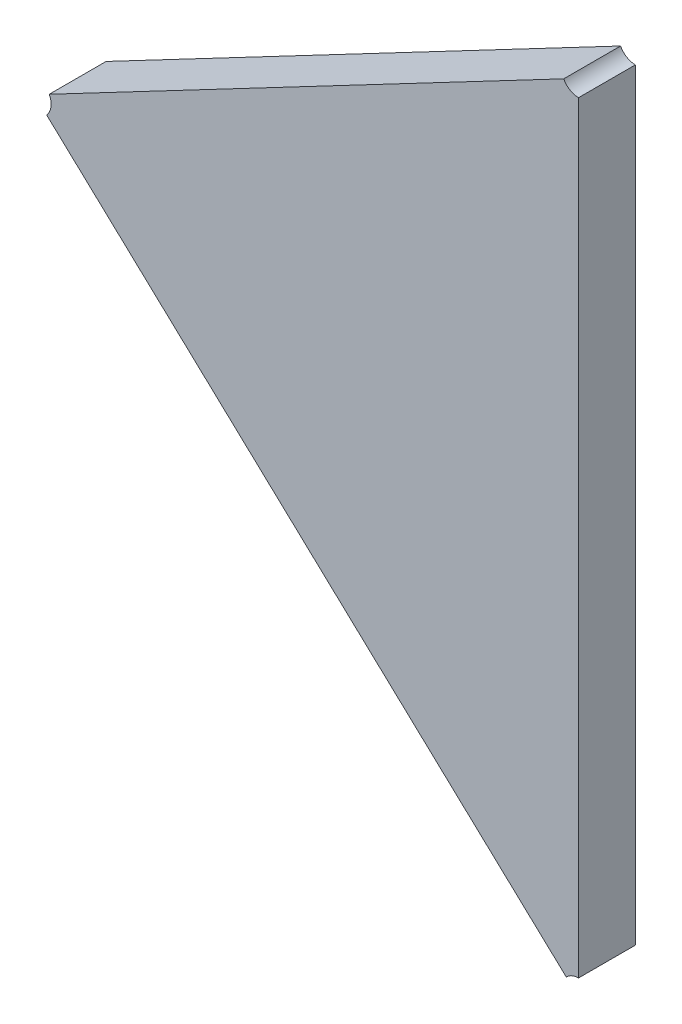
ISO-10303-21;
HEADER;
FILE_DESCRIPTION(('STEP AP214'),'2;1');
FILE_NAME('part.step','',(''),(''),'','','');
FILE_SCHEMA(('AUTOMOTIVE_DESIGN { 1 0 10303 214 1 1 1 1 }'));
ENDSEC;
DATA;
#1=APPLICATION_CONTEXT('core data for automotive mechanical design processes');
#2=APPLICATION_PROTOCOL_DEFINITION('international standard','automotive_design',2000,#1);
#3=PRODUCT_CONTEXT('',#1,'mechanical');
#4=PRODUCT('Part','Part','',(#3));
#5=PRODUCT_RELATED_PRODUCT_CATEGORY('part','',(#4));
#6=PRODUCT_DEFINITION_FORMATION('','',#4);
#7=PRODUCT_DEFINITION_CONTEXT('part definition',#1,'design');
#8=PRODUCT_DEFINITION('design','',#6,#7);
#9=PRODUCT_DEFINITION_SHAPE('','',#8);
#10=(LENGTH_UNIT() NAMED_UNIT(*) SI_UNIT(.MILLI.,.METRE.));
#11=(NAMED_UNIT(*) PLANE_ANGLE_UNIT() SI_UNIT($,.RADIAN.));
#12=(NAMED_UNIT(*) SI_UNIT($,.STERADIAN.) SOLID_ANGLE_UNIT());
#13=UNCERTAINTY_MEASURE_WITH_UNIT(LENGTH_MEASURE(1.E-05),#10,'distance_accuracy_value','');
#14=(GEOMETRIC_REPRESENTATION_CONTEXT(3) GLOBAL_UNCERTAINTY_ASSIGNED_CONTEXT((#13)) GLOBAL_UNIT_ASSIGNED_CONTEXT((#10,
#11,#12)) REPRESENTATION_CONTEXT('',''));
#15=CARTESIAN_POINT('',(0.,0.,0.));
#16=DIRECTION('',(0.,0.,1.));
#17=DIRECTION('',(1.,0.,0.));
#18=AXIS2_PLACEMENT_3D('',#15,#16,#17);
#19=CARTESIAN_POINT('',(-1.32073989294773,-1.28570071400538,0.0042));
#20=DIRECTION('',(0.,0.,1.));
#21=DIRECTION('',(1.,0.,0.));
#22=AXIS2_PLACEMENT_3D('',#19,#20,#21);
#23=PLANE('',#22);
#24=CARTESIAN_POINT('',(-1.31045874865729,-1.26331224779158,0.0042));
#25=DIRECTION('',(0.,0.,-1.));
#26=DIRECTION('',(0.,-1.,0.));
#27=AXIS2_PLACEMENT_3D('',#24,#25,#26);
#28=CIRCLE('',#27,0.00100000000000001);
#29=CARTESIAN_POINT('',(-1.31045874865729,-1.26431224779158,0.0042));
#30=VERTEX_POINT('',#29);
#31=CARTESIAN_POINT('',(-1.31134378812502,-1.26377776378545,0.0042));
#32=VERTEX_POINT('',#31);
#33=EDGE_CURVE('E11',#30,#32,#28,.T.);
#34=ORIENTED_EDGE('',*,*,#33,.T.);
#35=DIRECTION('',(-0.88503946773786,-0.465515993867326,0.));
#36=VECTOR('',#35,1.);
#37=CARTESIAN_POINT('',(-1.31134378812502,-1.26377776378545,0.0042));
#38=LINE('',#37,#36);
#39=CARTESIAN_POINT('',(-1.342108317435,-1.27995939292138,0.0042));
#40=VERTEX_POINT('',#39);
#41=EDGE_CURVE('E113',#32,#40,#38,.T.);
#42=ORIENTED_EDGE('',*,*,#41,.T.);
#43=CARTESIAN_POINT('',(-1.34299335690274,-1.28042490891524,0.0042));
#44=DIRECTION('',(0.,0.,-1.));
#45=DIRECTION('',(0.885039467741346,0.4655159938607,0.));
#46=AXIS2_PLACEMENT_3D('',#43,#44,#45);
#47=CIRCLE('',#46,0.00100000000000001);
#48=CARTESIAN_POINT('',(-1.34226353505596,-1.28110854629863,0.0042));
#49=VERTEX_POINT('',#48);
#50=EDGE_CURVE('E107',#40,#49,#47,.T.);
#51=ORIENTED_EDGE('',*,*,#50,.T.);
#52=DIRECTION('',(0.729821846781323,-0.683637383384422,0.));
#53=VECTOR('',#52,1.);
#54=CARTESIAN_POINT('',(-1.34226353505596,-1.28110854629863,0.0042));
#55=LINE('',#54,#53);
#56=CARTESIAN_POINT('',(-1.31118857050407,-1.31021703016864,0.0042));
#57=VERTEX_POINT('',#56);
#58=EDGE_CURVE('E71',#49,#57,#55,.T.);
#59=ORIENTED_EDGE('',*,*,#58,.T.);
#60=CARTESIAN_POINT('',(-1.31045874865729,-1.31090066755203,0.0042));
#61=DIRECTION('',(0.,0.,-1.));
#62=DIRECTION('',(-0.72982184677793,0.683637383388044,0.));
#63=AXIS2_PLACEMENT_3D('',#60,#61,#62);
#64=CIRCLE('',#63,0.00100000000000001);
#65=CARTESIAN_POINT('',(-1.31045874865729,-1.30990066755203,0.0042));
#66=VERTEX_POINT('',#65);
#67=EDGE_CURVE('E67',#57,#66,#64,.T.);
#68=ORIENTED_EDGE('',*,*,#67,.T.);
#69=DIRECTION('',(0.,1.,0.));
#70=VECTOR('',#69,1.);
#71=CARTESIAN_POINT('',(-1.31045874865729,-1.30990066755203,0.0042));
#72=LINE('',#71,#70);
#73=EDGE_CURVE('E69',#66,#30,#72,.T.);
#74=ORIENTED_EDGE('',*,*,#73,.T.);
#75=EDGE_LOOP('',(#34,#42,#51,#59,#68,#74));
#76=FACE_BOUND('',#75,.T.);
#77=ADVANCED_FACE('F17',(#76),#23,.T.);
#78=CARTESIAN_POINT('',(-1.32072164733338,-1.28572023478097,0.0008));
#79=DIRECTION('',(0.,0.,1.));
#80=DIRECTION('',(1.,0.,0.));
#81=AXIS2_PLACEMENT_3D('',#78,#79,#80);
#82=PLANE('',#81);
#83=CARTESIAN_POINT('',(-1.31045874865729,-1.26331224779158,0.0008));
#84=DIRECTION('',(0.,0.,1.));
#85=DIRECTION('',(-0.88503946773515,-0.46551599387248,0.));
#86=AXIS2_PLACEMENT_3D('',#83,#84,#85);
#87=CIRCLE('',#86,0.00100000000000001);
#88=CARTESIAN_POINT('',(-1.31134378812502,-1.26377776378545,0.0008));
#89=VERTEX_POINT('',#88);
#90=CARTESIAN_POINT('',(-1.31045874865729,-1.26431224779158,0.0008));
#91=VERTEX_POINT('',#90);
#92=EDGE_CURVE('E24',#89,#91,#87,.T.);
#93=ORIENTED_EDGE('',*,*,#92,.T.);
#94=DIRECTION('',(0.,1.,0.));
#95=VECTOR('',#94,1.);
#96=CARTESIAN_POINT('',(-1.31045874865729,-1.30990066755203,0.0008));
#97=LINE('',#96,#95);
#98=CARTESIAN_POINT('',(-1.31045874865729,-1.30990066755203,0.0008));
#99=VERTEX_POINT('',#98);
#100=EDGE_CURVE('E109',#99,#91,#97,.T.);
#101=ORIENTED_EDGE('',*,*,#100,.F.);
#102=CARTESIAN_POINT('',(-1.31045874865729,-1.31090066755203,0.0008));
#103=DIRECTION('',(0.,0.,1.));
#104=DIRECTION('',(0.,1.,0.));
#105=AXIS2_PLACEMENT_3D('',#102,#103,#104);
#106=CIRCLE('',#105,0.00100000000000001);
#107=CARTESIAN_POINT('',(-1.31118857050407,-1.31021703016864,0.0008));
#108=VERTEX_POINT('',#107);
#109=EDGE_CURVE('E87',#99,#108,#106,.T.);
#110=ORIENTED_EDGE('',*,*,#109,.T.);
#111=DIRECTION('',(0.729821846781321,-0.683637383384424,0.));
#112=VECTOR('',#111,1.);
#113=CARTESIAN_POINT('',(-1.34226353505596,-1.28110854629863,0.0008));
#114=LINE('',#113,#112);
#115=CARTESIAN_POINT('',(-1.34226353505596,-1.28110854629863,0.0008));
#116=VERTEX_POINT('',#115);
#117=EDGE_CURVE('E75',#116,#108,#114,.T.);
#118=ORIENTED_EDGE('',*,*,#117,.F.);
#119=CARTESIAN_POINT('',(-1.34299335690274,-1.28042490891524,0.0008));
#120=DIRECTION('',(0.,0.,1.));
#121=DIRECTION('',(0.72982184677793,-0.683637383388044,0.));
#122=AXIS2_PLACEMENT_3D('',#119,#120,#121);
#123=CIRCLE('',#122,0.00100000000000001);
#124=CARTESIAN_POINT('',(-1.342108317435,-1.27995939292138,0.0008));
#125=VERTEX_POINT('',#124);
#126=EDGE_CURVE('E88',#116,#125,#123,.T.);
#127=ORIENTED_EDGE('',*,*,#126,.T.);
#128=DIRECTION('',(-0.885039467737863,-0.465515993867321,0.));
#129=VECTOR('',#128,1.);
#130=CARTESIAN_POINT('',(-1.31134378812502,-1.26377776378544,0.0008));
#131=LINE('',#130,#129);
#132=EDGE_CURVE('E103',#89,#125,#131,.T.);
#133=ORIENTED_EDGE('',*,*,#132,.F.);
#134=EDGE_LOOP('',(#93,#101,#110,#118,#127,#133));
#135=FACE_BOUND('',#134,.T.);
#136=ADVANCED_FACE('F125',(#135),#82,.F.);
#137=CARTESIAN_POINT('',(-1.31045874865729,-1.26331224779158,0.0008));
#138=DIRECTION('',(-0.465515993867324,0.885039467737862,0.));
#139=DIRECTION('',(-0.885039467737862,-0.465515993867324,0.));
#140=AXIS2_PLACEMENT_3D('',#137,#138,#139);
#141=PLANE('',#140);
#142=DIRECTION('',(0.,0.,-1.));
#143=VECTOR('',#142,1.);
#144=CARTESIAN_POINT('',(-1.31134378812502,-1.26377776378545,0.0042));
#145=LINE('',#144,#143);
#146=EDGE_CURVE('E111',#32,#89,#145,.T.);
#147=ORIENTED_EDGE('',*,*,#146,.T.);
#148=ORIENTED_EDGE('',*,*,#132,.T.);
#149=DIRECTION('',(0.,0.,1.));
#150=VECTOR('',#149,1.);
#151=CARTESIAN_POINT('',(-1.342108317435,-1.27995939292138,0.0008));
#152=LINE('',#151,#150);
#153=EDGE_CURVE('E97',#125,#40,#152,.T.);
#154=ORIENTED_EDGE('',*,*,#153,.T.);
#155=ORIENTED_EDGE('',*,*,#41,.F.);
#156=EDGE_LOOP('',(#147,#148,#154,#155));
#157=FACE_BOUND('',#156,.T.);
#158=ADVANCED_FACE('F118',(#157),#141,.T.);
#159=CARTESIAN_POINT('',(-1.34299335690274,-1.28042490891524,0.0008));
#160=DIRECTION('',(-0.683637383384425,-0.729821846781321,0.));
#161=DIRECTION('',(0.729821846781321,-0.683637383384425,0.));
#162=AXIS2_PLACEMENT_3D('',#159,#160,#161);
#163=PLANE('',#162);
#164=DIRECTION('',(0.,0.,1.));
#165=VECTOR('',#164,1.);
#166=CARTESIAN_POINT('',(-1.31118857050407,-1.31021703016864,0.0008));
#167=LINE('',#166,#165);
#168=EDGE_CURVE('E105',#108,#57,#167,.T.);
#169=ORIENTED_EDGE('',*,*,#168,.T.);
#170=ORIENTED_EDGE('',*,*,#58,.F.);
#171=DIRECTION('',(0.,0.,-1.));
#172=VECTOR('',#171,1.);
#173=CARTESIAN_POINT('',(-1.34226353505596,-1.28110854629863,0.0042));
#174=LINE('',#173,#172);
#175=EDGE_CURVE('E84',#49,#116,#174,.T.);
#176=ORIENTED_EDGE('',*,*,#175,.T.);
#177=ORIENTED_EDGE('',*,*,#117,.T.);
#178=EDGE_LOOP('',(#169,#170,#176,#177));
#179=FACE_BOUND('',#178,.T.);
#180=ADVANCED_FACE('F124',(#179),#163,.T.);
#181=CARTESIAN_POINT('',(-1.31045874865729,-1.31090066755203,0.0008));
#182=DIRECTION('',(1.,0.,0.));
#183=DIRECTION('',(0.,1.,0.));
#184=AXIS2_PLACEMENT_3D('',#181,#182,#183);
#185=PLANE('',#184);
#186=DIRECTION('',(0.,0.,1.));
#187=VECTOR('',#186,1.);
#188=CARTESIAN_POINT('',(-1.31045874865729,-1.26431224779158,0.0008));
#189=LINE('',#188,#187);
#190=EDGE_CURVE('E83',#91,#30,#189,.T.);
#191=ORIENTED_EDGE('',*,*,#190,.T.);
#192=ORIENTED_EDGE('',*,*,#73,.F.);
#193=DIRECTION('',(0.,0.,-1.));
#194=VECTOR('',#193,1.);
#195=CARTESIAN_POINT('',(-1.31045874865729,-1.30990066755203,0.0042));
#196=LINE('',#195,#194);
#197=EDGE_CURVE('E80',#66,#99,#196,.T.);
#198=ORIENTED_EDGE('',*,*,#197,.T.);
#199=ORIENTED_EDGE('',*,*,#100,.T.);
#200=EDGE_LOOP('',(#191,#192,#198,#199));
#201=FACE_BOUND('',#200,.T.);
#202=ADVANCED_FACE('F79',(#201),#185,.T.);
#203=CARTESIAN_POINT('',(-1.34299335690274,-1.28042490891524,0.0012));
#204=DIRECTION('',(0.,0.,1.));
#205=DIRECTION('',(0.991000826132297,-0.133855752977242,0.));
#206=AXIS2_PLACEMENT_3D('',#203,#204,#205);
#207=CYLINDRICAL_SURFACE('',#206,0.00100000000000001);
#208=ORIENTED_EDGE('',*,*,#153,.F.);
#209=ORIENTED_EDGE('',*,*,#126,.F.);
#210=ORIENTED_EDGE('',*,*,#175,.F.);
#211=ORIENTED_EDGE('',*,*,#50,.F.);
#212=EDGE_LOOP('',(#208,#209,#210,#211));
#213=FACE_BOUND('',#212,.T.);
#214=ADVANCED_FACE('F122',(#213),#207,.F.);
#215=CARTESIAN_POINT('',(-1.31045874865729,-1.31090066755203,0.0012));
#216=DIRECTION('',(0.,0.,1.));
#217=DIRECTION('',(-1.,0.,0.));
#218=AXIS2_PLACEMENT_3D('',#215,#216,#217);
#219=CYLINDRICAL_SURFACE('',#218,0.00100000000000001);
#220=ORIENTED_EDGE('',*,*,#168,.F.);
#221=ORIENTED_EDGE('',*,*,#109,.F.);
#222=ORIENTED_EDGE('',*,*,#197,.F.);
#223=ORIENTED_EDGE('',*,*,#67,.F.);
#224=EDGE_LOOP('',(#220,#221,#222,#223));
#225=FACE_BOUND('',#224,.T.);
#226=ADVANCED_FACE('F86',(#225),#219,.F.);
#227=CARTESIAN_POINT('',(-1.31045874865729,-1.26331224779158,0.0012));
#228=DIRECTION('',(0.,0.,1.));
#229=DIRECTION('',(-1.,0.,0.));
#230=AXIS2_PLACEMENT_3D('',#227,#228,#229);
#231=CYLINDRICAL_SURFACE('',#230,0.00100000000000001);
#232=ORIENTED_EDGE('',*,*,#146,.F.);
#233=ORIENTED_EDGE('',*,*,#33,.F.);
#234=ORIENTED_EDGE('',*,*,#190,.F.);
#235=ORIENTED_EDGE('',*,*,#92,.F.);
#236=EDGE_LOOP('',(#232,#233,#234,#235));
#237=FACE_BOUND('',#236,.T.);
#238=ADVANCED_FACE('F127',(#237),#231,.F.);
#239=CLOSED_SHELL('',(#77,#136,#158,#180,#202,#214,#226,#238));
#240=MANIFOLD_SOLID_BREP('B1',#239);
#241=ADVANCED_BREP_SHAPE_REPRESENTATION('',(#18,#240),#14);
#242=SHAPE_DEFINITION_REPRESENTATION(#9,#241);
ENDSEC;
END-ISO-10303-21;
